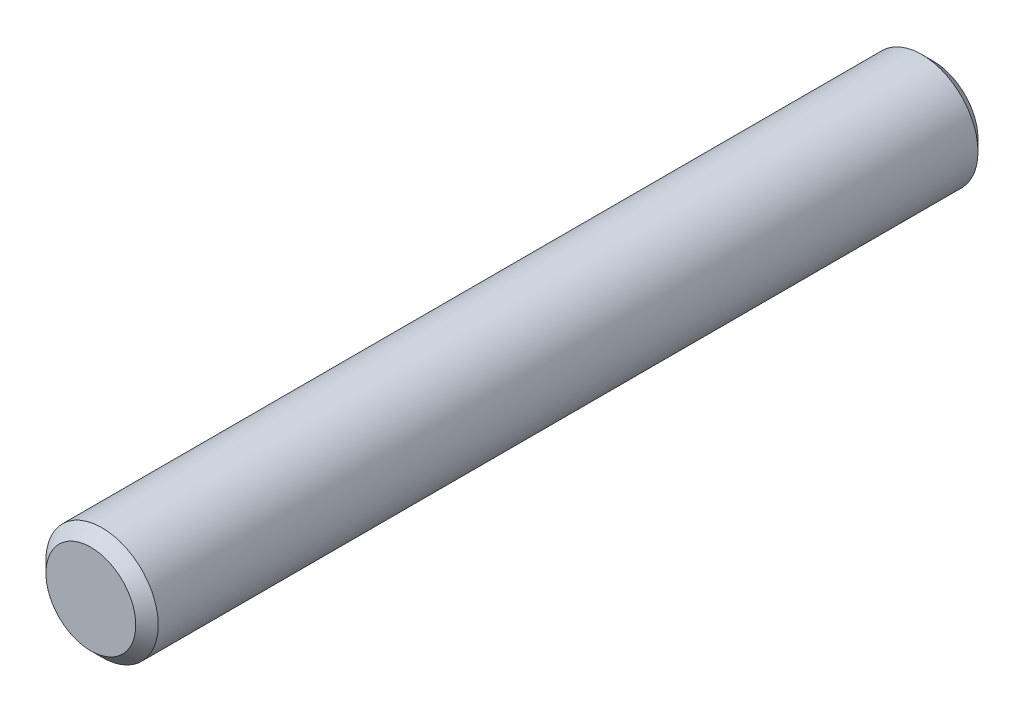
ISO-10303-21;
HEADER;
FILE_DESCRIPTION(('STEP AP214'),'2;1');
FILE_NAME('part.step','',(''),(''),'','','');
FILE_SCHEMA(('AUTOMOTIVE_DESIGN { 1 0 10303 214 1 1 1 1 }'));
ENDSEC;
DATA;
#1=APPLICATION_CONTEXT('core data for automotive mechanical design processes');
#2=APPLICATION_PROTOCOL_DEFINITION('international standard','automotive_design',2000,#1);
#3=PRODUCT_CONTEXT('',#1,'mechanical');
#4=PRODUCT('Part','Part','',(#3));
#5=PRODUCT_RELATED_PRODUCT_CATEGORY('part','',(#4));
#6=PRODUCT_DEFINITION_FORMATION('','',#4);
#7=PRODUCT_DEFINITION_CONTEXT('part definition',#1,'design');
#8=PRODUCT_DEFINITION('design','',#6,#7);
#9=PRODUCT_DEFINITION_SHAPE('','',#8);
#10=(LENGTH_UNIT() NAMED_UNIT(*) SI_UNIT(.MILLI.,.METRE.));
#11=(NAMED_UNIT(*) PLANE_ANGLE_UNIT() SI_UNIT($,.RADIAN.));
#12=(NAMED_UNIT(*) SI_UNIT($,.STERADIAN.) SOLID_ANGLE_UNIT());
#13=UNCERTAINTY_MEASURE_WITH_UNIT(LENGTH_MEASURE(1.E-05),#10,'distance_accuracy_value','');
#14=(GEOMETRIC_REPRESENTATION_CONTEXT(3) GLOBAL_UNCERTAINTY_ASSIGNED_CONTEXT((#13)) GLOBAL_UNIT_ASSIGNED_CONTEXT((#10,
#11,#12)) REPRESENTATION_CONTEXT('',''));
#15=CARTESIAN_POINT('',(0.,0.,0.));
#16=DIRECTION('',(0.,0.,1.));
#17=DIRECTION('',(1.,0.,0.));
#18=AXIS2_PLACEMENT_3D('',#15,#16,#17);
#19=CARTESIAN_POINT('',(0.,0.,7.5));
#20=DIRECTION('',(0.,0.,-1.));
#21=DIRECTION('',(-1.,0.,0.));
#22=AXIS2_PLACEMENT_3D('',#19,#20,#21);
#23=CYLINDRICAL_SURFACE('',#22,1.);
#24=CARTESIAN_POINT('',(0.,0.,-7.3));
#25=DIRECTION('',(0.,0.,1.));
#26=DIRECTION('',(1.,0.,0.));
#27=AXIS2_PLACEMENT_3D('',#24,#25,#26);
#28=CIRCLE('',#27,1.);
#29=CARTESIAN_POINT('',(1.,0.,-7.3));
#30=VERTEX_POINT('',#29);
#31=EDGE_CURVE('E44',#30,#30,#28,.T.);
#32=ORIENTED_EDGE('',*,*,#31,.T.);
#33=EDGE_LOOP('',(#32));
#34=FACE_BOUND('',#33,.T.);
#35=CARTESIAN_POINT('',(0.,0.,7.3));
#36=DIRECTION('',(0.,0.,1.));
#37=DIRECTION('',(1.,0.,0.));
#38=AXIS2_PLACEMENT_3D('',#35,#36,#37);
#39=CIRCLE('',#38,1.);
#40=CARTESIAN_POINT('',(1.,0.,7.3));
#41=VERTEX_POINT('',#40);
#42=EDGE_CURVE('E48',#41,#41,#39,.F.);
#43=ORIENTED_EDGE('',*,*,#42,.T.);
#44=EDGE_LOOP('',(#43));
#45=FACE_BOUND('',#44,.T.);
#46=ADVANCED_FACE('F32',(#34,#45),#23,.T.);
#47=CARTESIAN_POINT('',(0.,0.,7.5));
#48=DIRECTION('',(0.,0.,1.));
#49=DIRECTION('',(1.,0.,0.));
#50=AXIS2_PLACEMENT_3D('',#47,#48,#49);
#51=PLANE('',#50);
#52=CARTESIAN_POINT('',(0.,0.,7.5));
#53=DIRECTION('',(0.,0.,1.));
#54=DIRECTION('',(1.,0.,0.));
#55=AXIS2_PLACEMENT_3D('',#52,#53,#54);
#56=CIRCLE('',#55,0.8);
#57=CARTESIAN_POINT('',(0.8,0.,7.5));
#58=VERTEX_POINT('',#57);
#59=EDGE_CURVE('E10',#58,#58,#56,.T.);
#60=ORIENTED_EDGE('',*,*,#59,.T.);
#61=EDGE_LOOP('',(#60));
#62=FACE_BOUND('',#61,.T.);
#63=ADVANCED_FACE('F64',(#62),#51,.T.);
#64=CARTESIAN_POINT('',(0.,0.,-7.5));
#65=DIRECTION('',(0.,0.,1.));
#66=DIRECTION('',(1.,0.,0.));
#67=AXIS2_PLACEMENT_3D('',#64,#65,#66);
#68=PLANE('',#67);
#69=CARTESIAN_POINT('',(0.,0.,-7.5));
#70=DIRECTION('',(0.,0.,1.));
#71=DIRECTION('',(1.,0.,0.));
#72=AXIS2_PLACEMENT_3D('',#69,#70,#71);
#73=CIRCLE('',#72,0.799999999999997);
#74=CARTESIAN_POINT('',(0.799999999999997,0.,-7.5));
#75=VERTEX_POINT('',#74);
#76=EDGE_CURVE('E40',#75,#75,#73,.F.);
#77=ORIENTED_EDGE('',*,*,#76,.T.);
#78=EDGE_LOOP('',(#77));
#79=FACE_BOUND('',#78,.T.);
#80=ADVANCED_FACE('F61',(#79),#68,.F.);
#81=CARTESIAN_POINT('',(0.,0.,-7.3));
#82=DIRECTION('',(0.,0.,1.));
#83=DIRECTION('',(1.,0.,0.));
#84=AXIS2_PLACEMENT_3D('',#81,#82,#83);
#85=CONICAL_SURFACE('',#84,1.,0.78539816339745);
#86=ORIENTED_EDGE('',*,*,#76,.F.);
#87=EDGE_LOOP('',(#86));
#88=FACE_BOUND('',#87,.T.);
#89=ORIENTED_EDGE('',*,*,#31,.F.);
#90=EDGE_LOOP('',(#89));
#91=FACE_BOUND('',#90,.T.);
#92=ADVANCED_FACE('F57',(#88,#91),#85,.T.);
#93=CARTESIAN_POINT('',(0.,0.,7.5));
#94=DIRECTION('',(0.,0.,-1.));
#95=DIRECTION('',(-1.,0.,0.));
#96=AXIS2_PLACEMENT_3D('',#93,#94,#95);
#97=CONICAL_SURFACE('',#96,0.8,0.785398163397453);
#98=ORIENTED_EDGE('',*,*,#42,.F.);
#99=EDGE_LOOP('',(#98));
#100=FACE_BOUND('',#99,.T.);
#101=ORIENTED_EDGE('',*,*,#59,.F.);
#102=EDGE_LOOP('',(#101));
#103=FACE_BOUND('',#102,.T.);
#104=ADVANCED_FACE('F35',(#100,#103),#97,.T.);
#105=CLOSED_SHELL('',(#46,#63,#80,#92,#104));
#106=MANIFOLD_SOLID_BREP('B2',#105);
#107=ADVANCED_BREP_SHAPE_REPRESENTATION('',(#18,#106),#14);
#108=SHAPE_DEFINITION_REPRESENTATION(#9,#107);
ENDSEC;
END-ISO-10303-21;
